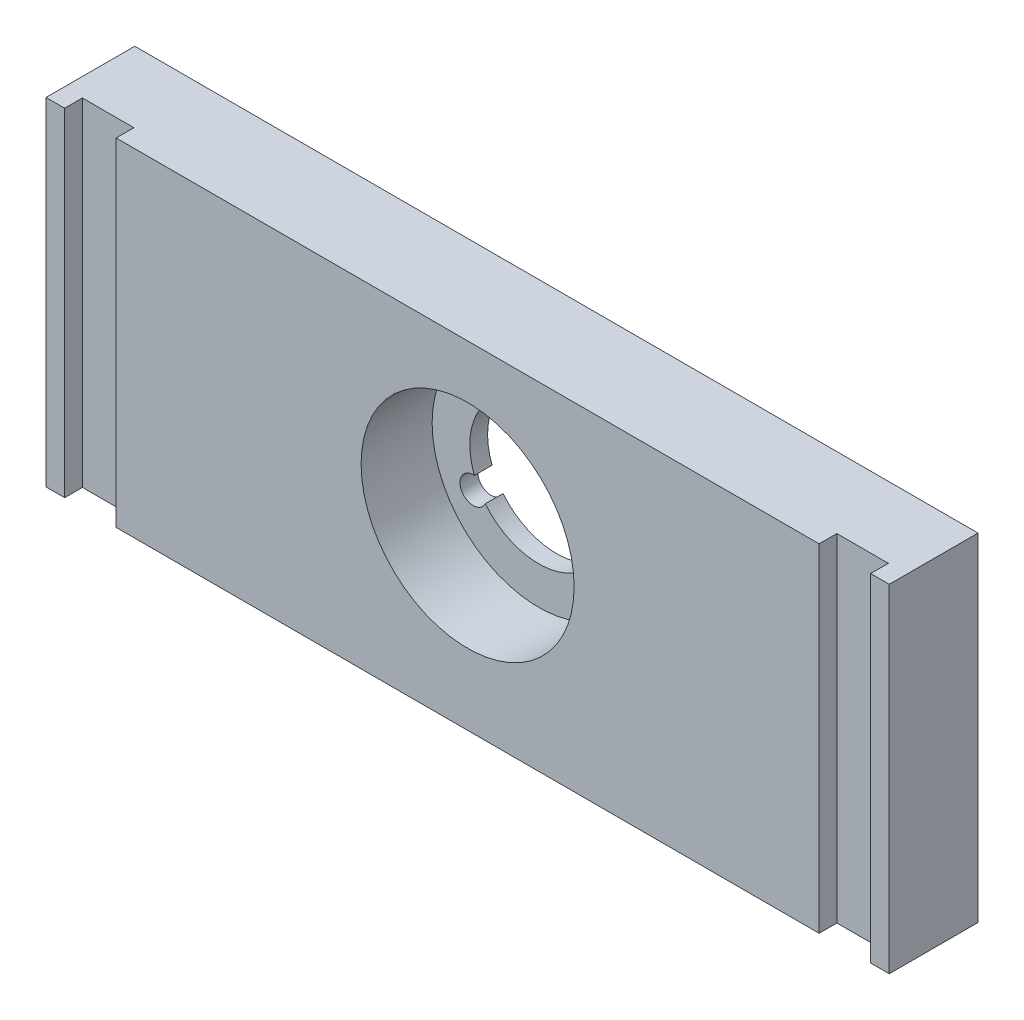
ISO-10303-21;
HEADER;
FILE_DESCRIPTION(('STEP AP214'),'2;1');
FILE_NAME('part.step','',(''),(''),'','','');
FILE_SCHEMA(('AUTOMOTIVE_DESIGN { 1 0 10303 214 1 1 1 1 }'));
ENDSEC;
DATA;
#1=APPLICATION_CONTEXT('core data for automotive mechanical design processes');
#2=APPLICATION_PROTOCOL_DEFINITION('international standard','automotive_design',2000,#1);
#3=PRODUCT_CONTEXT('',#1,'mechanical');
#4=PRODUCT('Part','Part','',(#3));
#5=PRODUCT_RELATED_PRODUCT_CATEGORY('part','',(#4));
#6=PRODUCT_DEFINITION_FORMATION('','',#4);
#7=PRODUCT_DEFINITION_CONTEXT('part definition',#1,'design');
#8=PRODUCT_DEFINITION('design','',#6,#7);
#9=PRODUCT_DEFINITION_SHAPE('','',#8);
#10=(LENGTH_UNIT() NAMED_UNIT(*) SI_UNIT(.MILLI.,.METRE.));
#11=(NAMED_UNIT(*) PLANE_ANGLE_UNIT() SI_UNIT($,.RADIAN.));
#12=(NAMED_UNIT(*) SI_UNIT($,.STERADIAN.) SOLID_ANGLE_UNIT());
#13=UNCERTAINTY_MEASURE_WITH_UNIT(LENGTH_MEASURE(1.E-05),#10,'distance_accuracy_value','');
#14=(GEOMETRIC_REPRESENTATION_CONTEXT(3) GLOBAL_UNCERTAINTY_ASSIGNED_CONTEXT((#13)) GLOBAL_UNIT_ASSIGNED_CONTEXT((#10,
#11,#12)) REPRESENTATION_CONTEXT('',''));
#15=CARTESIAN_POINT('',(0.,0.,0.));
#16=DIRECTION('',(0.,0.,1.));
#17=DIRECTION('',(1.,0.,0.));
#18=AXIS2_PLACEMENT_3D('',#15,#16,#17);
#19=CARTESIAN_POINT('',(3.,-2.,10.));
#20=DIRECTION('',(0.,0.,-1.));
#21=DIRECTION('',(-1.,0.,0.));
#22=AXIS2_PLACEMENT_3D('',#19,#20,#21);
#23=PLANE('',#22);
#24=CARTESIAN_POINT('',(50.5,-20.,10.));
#25=DIRECTION('',(0.,0.,1.));
#26=DIRECTION('',(1.,0.,0.));
#27=AXIS2_PLACEMENT_3D('',#24,#25,#26);
#28=CIRCLE('',#27,12.);
#29=CARTESIAN_POINT('',(62.5,-20.,10.));
#30=VERTEX_POINT('',#29);
#31=EDGE_CURVE('E207',#30,#30,#28,.T.);
#32=ORIENTED_EDGE('',*,*,#31,.F.);
#33=EDGE_LOOP('',(#32));
#34=FACE_BOUND('',#33,.T.);
#35=DIRECTION('',(1.,0.,0.));
#36=VECTOR('',#35,1.);
#37=CARTESIAN_POINT('',(98.,-40.,10.));
#38=LINE('',#37,#36);
#39=CARTESIAN_POINT('',(10.9,-40.,10.));
#40=VERTEX_POINT('',#39);
#41=CARTESIAN_POINT('',(90.1,-40.,10.));
#42=VERTEX_POINT('',#41);
#43=EDGE_CURVE('E274',#40,#42,#38,.T.);
#44=ORIENTED_EDGE('',*,*,#43,.T.);
#45=DIRECTION('',(0.,-1.,0.));
#46=VECTOR('',#45,1.);
#47=CARTESIAN_POINT('',(90.1,-40.,10.));
#48=LINE('',#47,#46);
#49=CARTESIAN_POINT('',(90.1,-2.,10.));
#50=VERTEX_POINT('',#49);
#51=EDGE_CURVE('E161',#50,#42,#48,.T.);
#52=ORIENTED_EDGE('',*,*,#51,.F.);
#53=DIRECTION('',(-1.,0.,0.));
#54=VECTOR('',#53,1.);
#55=CARTESIAN_POINT('',(3.,-2.,10.));
#56=LINE('',#55,#54);
#57=CARTESIAN_POINT('',(10.9,-2.,10.));
#58=VERTEX_POINT('',#57);
#59=EDGE_CURVE('E281',#50,#58,#56,.T.);
#60=ORIENTED_EDGE('',*,*,#59,.T.);
#61=DIRECTION('',(0.,1.,0.));
#62=VECTOR('',#61,1.);
#63=CARTESIAN_POINT('',(10.9,-40.,10.));
#64=LINE('',#63,#62);
#65=EDGE_CURVE('E186',#40,#58,#64,.T.);
#66=ORIENTED_EDGE('',*,*,#65,.F.);
#67=EDGE_LOOP('',(#44,#52,#60,#66));
#68=FACE_BOUND('',#67,.T.);
#69=ADVANCED_FACE('F31',(#34,#68),#23,.F.);
#70=CARTESIAN_POINT('',(3.,-40.,10.));
#71=VERTEX_POINT('',#70);
#72=CARTESIAN_POINT('',(5.1,-40.,10.));
#73=VERTEX_POINT('',#72);
#74=EDGE_CURVE('E270',#71,#73,#38,.T.);
#75=ORIENTED_EDGE('',*,*,#74,.T.);
#76=DIRECTION('',(0.,-1.,0.));
#77=VECTOR('',#76,1.);
#78=CARTESIAN_POINT('',(5.1,-40.,10.));
#79=LINE('',#78,#77);
#80=CARTESIAN_POINT('',(5.1,-2.,10.));
#81=VERTEX_POINT('',#80);
#82=EDGE_CURVE('E193',#81,#73,#79,.T.);
#83=ORIENTED_EDGE('',*,*,#82,.F.);
#84=CARTESIAN_POINT('',(3.,-2.,10.));
#85=VERTEX_POINT('',#84);
#86=EDGE_CURVE('E276',#81,#85,#56,.T.);
#87=ORIENTED_EDGE('',*,*,#86,.T.);
#88=DIRECTION('',(0.,-1.,0.));
#89=VECTOR('',#88,1.);
#90=CARTESIAN_POINT('',(3.,-40.,10.));
#91=LINE('',#90,#89);
#92=EDGE_CURVE('E265',#85,#71,#91,.T.);
#93=ORIENTED_EDGE('',*,*,#92,.T.);
#94=EDGE_LOOP('',(#75,#83,#87,#93));
#95=FACE_BOUND('',#94,.T.);
#96=ADVANCED_FACE('F334',(#95),#23,.F.);
#97=CARTESIAN_POINT('',(50.5,-20.,10.));
#98=DIRECTION('',(0.,0.,-1.));
#99=DIRECTION('',(-1.,0.,0.));
#100=AXIS2_PLACEMENT_3D('',#97,#98,#99);
#101=CYLINDRICAL_SURFACE('',#100,7.75);
#102=DIRECTION('',(0.,0.,-1.));
#103=VECTOR('',#102,1.);
#104=CARTESIAN_POINT('',(57.7439441639614,-22.754591249062,10.));
#105=LINE('',#104,#103);
#106=CARTESIAN_POINT('',(57.7439441639614,-22.754591249062,2.));
#107=VERTEX_POINT('',#106);
#108=CARTESIAN_POINT('',(57.7439441639614,-22.754591249062,0.));
#109=VERTEX_POINT('',#108);
#110=EDGE_CURVE('E252',#107,#109,#105,.T.);
#111=ORIENTED_EDGE('',*,*,#110,.F.);
#112=CARTESIAN_POINT('',(50.5,-20.,2.));
#113=DIRECTION('',(0.,0.,1.));
#114=DIRECTION('',(1.,0.,0.));
#115=AXIS2_PLACEMENT_3D('',#112,#113,#114);
#116=CIRCLE('',#115,7.75);
#117=CARTESIAN_POINT('',(51.7364260832507,-12.3492647058823,2.));
#118=VERTEX_POINT('',#117);
#119=EDGE_CURVE('E231',#107,#118,#116,.T.);
#120=ORIENTED_EDGE('',*,*,#119,.T.);
#121=DIRECTION('',(0.,0.,-1.));
#122=VECTOR('',#121,1.);
#123=CARTESIAN_POINT('',(51.7364260832507,-12.3492647058823,10.));
#124=LINE('',#123,#122);
#125=CARTESIAN_POINT('',(51.7364260832507,-12.3492647058823,0.));
#126=VERTEX_POINT('',#125);
#127=EDGE_CURVE('E262',#118,#126,#124,.T.);
#128=ORIENTED_EDGE('',*,*,#127,.T.);
#129=CARTESIAN_POINT('',(50.5,-20.,0.));
#130=DIRECTION('',(0.,0.,1.));
#131=DIRECTION('',(1.,0.,0.));
#132=AXIS2_PLACEMENT_3D('',#129,#130,#131);
#133=CIRCLE('',#132,7.75);
#134=EDGE_CURVE('E234',#109,#126,#133,.T.);
#135=ORIENTED_EDGE('',*,*,#134,.F.);
#136=EDGE_LOOP('',(#111,#120,#128,#135));
#137=FACE_BOUND('',#136,.T.);
#138=ADVANCED_FACE('F336',(#137),#101,.F.);
#139=CARTESIAN_POINT('',(50.5,-11.5,10.));
#140=DIRECTION('',(0.,0.,-1.));
#141=DIRECTION('',(-1.,0.,0.));
#142=AXIS2_PLACEMENT_3D('',#139,#140,#141);
#143=CYLINDRICAL_SURFACE('',#142,1.5);
#144=ORIENTED_EDGE('',*,*,#127,.F.);
#145=CARTESIAN_POINT('',(50.5,-11.5,2.));
#146=DIRECTION('',(0.,0.,1.));
#147=DIRECTION('',(1.,0.,0.));
#148=AXIS2_PLACEMENT_3D('',#145,#146,#147);
#149=CIRCLE('',#148,1.5);
#150=CARTESIAN_POINT('',(49.2635739167494,-12.3492647058823,2.));
#151=VERTEX_POINT('',#150);
#152=EDGE_CURVE('E228',#118,#151,#149,.T.);
#153=ORIENTED_EDGE('',*,*,#152,.T.);
#154=DIRECTION('',(0.,0.,-1.));
#155=VECTOR('',#154,1.);
#156=CARTESIAN_POINT('',(49.2635739167494,-12.3492647058823,10.));
#157=LINE('',#156,#155);
#158=CARTESIAN_POINT('',(49.2635739167494,-12.3492647058823,0.));
#159=VERTEX_POINT('',#158);
#160=EDGE_CURVE('E260',#151,#159,#157,.T.);
#161=ORIENTED_EDGE('',*,*,#160,.T.);
#162=CARTESIAN_POINT('',(50.5,-11.5,0.));
#163=DIRECTION('',(0.,0.,1.));
#164=DIRECTION('',(1.,0.,0.));
#165=AXIS2_PLACEMENT_3D('',#162,#163,#164);
#166=CIRCLE('',#165,1.5);
#167=EDGE_CURVE('E237',#126,#159,#166,.T.);
#168=ORIENTED_EDGE('',*,*,#167,.F.);
#169=EDGE_LOOP('',(#144,#153,#161,#168));
#170=FACE_BOUND('',#169,.T.);
#171=ADVANCED_FACE('F342',(#170),#143,.F.);
#172=CARTESIAN_POINT('',(50.5,-20.,10.));
#173=DIRECTION('',(0.,0.,-1.));
#174=DIRECTION('',(-1.,0.,0.));
#175=AXIS2_PLACEMENT_3D('',#172,#173,#174);
#176=CYLINDRICAL_SURFACE('',#175,7.75);
#177=ORIENTED_EDGE('',*,*,#160,.F.);
#178=CARTESIAN_POINT('',(50.5,-20.,2.));
#179=DIRECTION('',(0.,0.,1.));
#180=DIRECTION('',(1.,0.,0.));
#181=AXIS2_PLACEMENT_3D('',#178,#179,#180);
#182=CIRCLE('',#181,7.75);
#183=CARTESIAN_POINT('',(43.2560558360386,-22.754591249062,2.));
#184=VERTEX_POINT('',#183);
#185=EDGE_CURVE('E225',#151,#184,#182,.T.);
#186=ORIENTED_EDGE('',*,*,#185,.T.);
#187=DIRECTION('',(0.,0.,-1.));
#188=VECTOR('',#187,1.);
#189=CARTESIAN_POINT('',(43.2560558360386,-22.754591249062,10.));
#190=LINE('',#189,#188);
#191=CARTESIAN_POINT('',(43.2560558360386,-22.754591249062,0.));
#192=VERTEX_POINT('',#191);
#193=EDGE_CURVE('E258',#184,#192,#190,.T.);
#194=ORIENTED_EDGE('',*,*,#193,.T.);
#195=CARTESIAN_POINT('',(50.5,-20.,0.));
#196=DIRECTION('',(0.,0.,1.));
#197=DIRECTION('',(1.,0.,0.));
#198=AXIS2_PLACEMENT_3D('',#195,#196,#197);
#199=CIRCLE('',#198,7.75);
#200=EDGE_CURVE('E240',#159,#192,#199,.T.);
#201=ORIENTED_EDGE('',*,*,#200,.F.);
#202=EDGE_LOOP('',(#177,#186,#194,#201));
#203=FACE_BOUND('',#202,.T.);
#204=ADVANCED_FACE('F369',(#203),#176,.F.);
#205=CARTESIAN_POINT('',(43.1387840678324,-24.25,10.));
#206=DIRECTION('',(0.,0.,-1.));
#207=DIRECTION('',(-1.,0.,0.));
#208=AXIS2_PLACEMENT_3D('',#205,#206,#207);
#209=CYLINDRICAL_SURFACE('',#208,1.50000000000001);
#210=ORIENTED_EDGE('',*,*,#193,.F.);
#211=CARTESIAN_POINT('',(43.1387840678324,-24.25,2.));
#212=DIRECTION('',(0.,0.,1.));
#213=DIRECTION('',(1.,0.,0.));
#214=AXIS2_PLACEMENT_3D('',#211,#212,#213);
#215=CIRCLE('',#214,1.50000000000001);
#216=CARTESIAN_POINT('',(44.4924819192894,-24.8961440450557,2.));
#217=VERTEX_POINT('',#216);
#218=EDGE_CURVE('E222',#184,#217,#215,.T.);
#219=ORIENTED_EDGE('',*,*,#218,.T.);
#220=DIRECTION('',(0.,0.,-1.));
#221=VECTOR('',#220,1.);
#222=CARTESIAN_POINT('',(44.4924819192894,-24.8961440450557,10.));
#223=LINE('',#222,#221);
#224=CARTESIAN_POINT('',(44.4924819192894,-24.8961440450557,0.));
#225=VERTEX_POINT('',#224);
#226=EDGE_CURVE('E256',#217,#225,#223,.T.);
#227=ORIENTED_EDGE('',*,*,#226,.T.);
#228=CARTESIAN_POINT('',(43.1387840678324,-24.25,0.));
#229=DIRECTION('',(0.,0.,1.));
#230=DIRECTION('',(1.,0.,0.));
#231=AXIS2_PLACEMENT_3D('',#228,#229,#230);
#232=CIRCLE('',#231,1.50000000000001);
#233=EDGE_CURVE('E243',#192,#225,#232,.T.);
#234=ORIENTED_EDGE('',*,*,#233,.F.);
#235=EDGE_LOOP('',(#210,#219,#227,#234));
#236=FACE_BOUND('',#235,.T.);
#237=ADVANCED_FACE('F359',(#236),#209,.F.);
#238=CARTESIAN_POINT('',(50.5,-20.,10.));
#239=DIRECTION('',(0.,0.,-1.));
#240=DIRECTION('',(-1.,0.,0.));
#241=AXIS2_PLACEMENT_3D('',#238,#239,#240);
#242=CYLINDRICAL_SURFACE('',#241,7.75);
#243=ORIENTED_EDGE('',*,*,#226,.F.);
#244=CARTESIAN_POINT('',(50.5,-20.,2.));
#245=DIRECTION('',(0.,0.,1.));
#246=DIRECTION('',(1.,0.,0.));
#247=AXIS2_PLACEMENT_3D('',#244,#245,#246);
#248=CIRCLE('',#247,7.75);
#249=CARTESIAN_POINT('',(56.5075180807109,-24.8961440450554,2.));
#250=VERTEX_POINT('',#249);
#251=EDGE_CURVE('E217',#217,#250,#248,.T.);
#252=ORIENTED_EDGE('',*,*,#251,.T.);
#253=DIRECTION('',(0.,0.,-1.));
#254=VECTOR('',#253,1.);
#255=CARTESIAN_POINT('',(56.5075180807109,-24.8961440450554,10.));
#256=LINE('',#255,#254);
#257=CARTESIAN_POINT('',(56.5075180807109,-24.8961440450554,0.));
#258=VERTEX_POINT('',#257);
#259=EDGE_CURVE('E254',#250,#258,#256,.T.);
#260=ORIENTED_EDGE('',*,*,#259,.T.);
#261=CARTESIAN_POINT('',(50.5,-20.,0.));
#262=DIRECTION('',(0.,0.,1.));
#263=DIRECTION('',(1.,0.,0.));
#264=AXIS2_PLACEMENT_3D('',#261,#262,#263);
#265=CIRCLE('',#264,7.75);
#266=EDGE_CURVE('E246',#225,#258,#265,.T.);
#267=ORIENTED_EDGE('',*,*,#266,.F.);
#268=EDGE_LOOP('',(#243,#252,#260,#267));
#269=FACE_BOUND('',#268,.T.);
#270=ADVANCED_FACE('F353',(#269),#242,.F.);
#271=CARTESIAN_POINT('',(57.8612159321679,-24.2499999999999,10.));
#272=DIRECTION('',(0.,0.,-1.));
#273=DIRECTION('',(-1.,0.,0.));
#274=AXIS2_PLACEMENT_3D('',#271,#272,#273);
#275=CYLINDRICAL_SURFACE('',#274,1.5);
#276=ORIENTED_EDGE('',*,*,#259,.F.);
#277=CARTESIAN_POINT('',(57.8612159321679,-24.2499999999999,2.));
#278=DIRECTION('',(0.,0.,1.));
#279=DIRECTION('',(1.,0.,0.));
#280=AXIS2_PLACEMENT_3D('',#277,#278,#279);
#281=CIRCLE('',#280,1.5);
#282=EDGE_CURVE('E11',#250,#107,#281,.T.);
#283=ORIENTED_EDGE('',*,*,#282,.T.);
#284=ORIENTED_EDGE('',*,*,#110,.T.);
#285=CARTESIAN_POINT('',(57.8612159321679,-24.2499999999999,0.));
#286=DIRECTION('',(0.,0.,1.));
#287=DIRECTION('',(1.,0.,0.));
#288=AXIS2_PLACEMENT_3D('',#285,#286,#287);
#289=CIRCLE('',#288,1.5);
#290=EDGE_CURVE('E249',#258,#109,#289,.T.);
#291=ORIENTED_EDGE('',*,*,#290,.F.);
#292=EDGE_LOOP('',(#276,#283,#284,#291));
#293=FACE_BOUND('',#292,.T.);
#294=ADVANCED_FACE('F348',(#293),#275,.F.);
#295=CARTESIAN_POINT('',(98.,-2.,10.));
#296=VERTEX_POINT('',#295);
#297=CARTESIAN_POINT('',(95.9,-2.,10.));
#298=VERTEX_POINT('',#297);
#299=EDGE_CURVE('E277',#296,#298,#56,.T.);
#300=ORIENTED_EDGE('',*,*,#299,.T.);
#301=DIRECTION('',(0.,1.,0.));
#302=VECTOR('',#301,1.);
#303=CARTESIAN_POINT('',(95.9,-40.,10.));
#304=LINE('',#303,#302);
#305=CARTESIAN_POINT('',(95.9,-40.,10.));
#306=VERTEX_POINT('',#305);
#307=EDGE_CURVE('E174',#306,#298,#304,.T.);
#308=ORIENTED_EDGE('',*,*,#307,.F.);
#309=CARTESIAN_POINT('',(98.,-40.,10.));
#310=VERTEX_POINT('',#309);
#311=EDGE_CURVE('E268',#306,#310,#38,.T.);
#312=ORIENTED_EDGE('',*,*,#311,.T.);
#313=DIRECTION('',(0.,1.,0.));
#314=VECTOR('',#313,1.);
#315=CARTESIAN_POINT('',(98.,-2.,10.));
#316=LINE('',#315,#314);
#317=EDGE_CURVE('E273',#310,#296,#316,.T.);
#318=ORIENTED_EDGE('',*,*,#317,.T.);
#319=EDGE_LOOP('',(#300,#308,#312,#318));
#320=FACE_BOUND('',#319,.T.);
#321=ADVANCED_FACE('F318',(#320),#23,.F.);
#322=CARTESIAN_POINT('',(3.,-2.,0.));
#323=DIRECTION('',(0.,0.,-1.));
#324=DIRECTION('',(-1.,0.,0.));
#325=AXIS2_PLACEMENT_3D('',#322,#323,#324);
#326=PLANE('',#325);
#327=DIRECTION('',(0.,-1.,0.));
#328=VECTOR('',#327,1.);
#329=CARTESIAN_POINT('',(3.,-40.,0.));
#330=LINE('',#329,#328);
#331=CARTESIAN_POINT('',(3.,-2.,0.));
#332=VERTEX_POINT('',#331);
#333=CARTESIAN_POINT('',(3.,-40.,0.));
#334=VERTEX_POINT('',#333);
#335=EDGE_CURVE('E264',#332,#334,#330,.T.);
#336=ORIENTED_EDGE('',*,*,#335,.F.);
#337=DIRECTION('',(-1.,0.,0.));
#338=VECTOR('',#337,1.);
#339=CARTESIAN_POINT('',(3.,-2.,0.));
#340=LINE('',#339,#338);
#341=CARTESIAN_POINT('',(98.,-2.,0.));
#342=VERTEX_POINT('',#341);
#343=EDGE_CURVE('E269',#342,#332,#340,.T.);
#344=ORIENTED_EDGE('',*,*,#343,.F.);
#345=DIRECTION('',(0.,1.,0.));
#346=VECTOR('',#345,1.);
#347=CARTESIAN_POINT('',(98.,-2.,0.));
#348=LINE('',#347,#346);
#349=CARTESIAN_POINT('',(98.,-40.,0.));
#350=VERTEX_POINT('',#349);
#351=EDGE_CURVE('E286',#350,#342,#348,.T.);
#352=ORIENTED_EDGE('',*,*,#351,.F.);
#353=DIRECTION('',(1.,0.,0.));
#354=VECTOR('',#353,1.);
#355=CARTESIAN_POINT('',(98.,-40.,0.));
#356=LINE('',#355,#354);
#357=EDGE_CURVE('E284',#334,#350,#356,.T.);
#358=ORIENTED_EDGE('',*,*,#357,.F.);
#359=EDGE_LOOP('',(#336,#344,#352,#358));
#360=FACE_BOUND('',#359,.T.);
#361=ORIENTED_EDGE('',*,*,#290,.T.);
#362=ORIENTED_EDGE('',*,*,#134,.T.);
#363=ORIENTED_EDGE('',*,*,#167,.T.);
#364=ORIENTED_EDGE('',*,*,#200,.T.);
#365=ORIENTED_EDGE('',*,*,#233,.T.);
#366=ORIENTED_EDGE('',*,*,#266,.T.);
#367=EDGE_LOOP('',(#361,#362,#363,#364,#365,#366));
#368=FACE_BOUND('',#367,.T.);
#369=ADVANCED_FACE('F305',(#360,#368),#326,.T.);
#370=CARTESIAN_POINT('',(3.,-40.,10.));
#371=DIRECTION('',(1.,0.,0.));
#372=DIRECTION('',(0.,0.,-1.));
#373=AXIS2_PLACEMENT_3D('',#370,#371,#372);
#374=PLANE('',#373);
#375=ORIENTED_EDGE('',*,*,#335,.T.);
#376=DIRECTION('',(0.,0.,-1.));
#377=VECTOR('',#376,1.);
#378=CARTESIAN_POINT('',(3.,-40.,10.));
#379=LINE('',#378,#377);
#380=EDGE_CURVE('E39',#71,#334,#379,.T.);
#381=ORIENTED_EDGE('',*,*,#380,.F.);
#382=ORIENTED_EDGE('',*,*,#92,.F.);
#383=DIRECTION('',(0.,0.,-1.));
#384=VECTOR('',#383,1.);
#385=CARTESIAN_POINT('',(3.,-2.,10.));
#386=LINE('',#385,#384);
#387=EDGE_CURVE('E280',#85,#332,#386,.T.);
#388=ORIENTED_EDGE('',*,*,#387,.T.);
#389=EDGE_LOOP('',(#375,#381,#382,#388));
#390=FACE_BOUND('',#389,.T.);
#391=ADVANCED_FACE('F33',(#390),#374,.F.);
#392=CARTESIAN_POINT('',(98.,-40.,10.));
#393=DIRECTION('',(0.,1.,0.));
#394=DIRECTION('',(-1.,0.,0.));
#395=AXIS2_PLACEMENT_3D('',#392,#393,#394);
#396=PLANE('',#395);
#397=DIRECTION('',(1.,0.,0.));
#398=VECTOR('',#397,1.);
#399=CARTESIAN_POINT('',(90.1,-40.,8.));
#400=LINE('',#399,#398);
#401=CARTESIAN_POINT('',(90.1,-40.,8.));
#402=VERTEX_POINT('',#401);
#403=CARTESIAN_POINT('',(95.9,-40.,8.));
#404=VERTEX_POINT('',#403);
#405=EDGE_CURVE('E170',#402,#404,#400,.T.);
#406=ORIENTED_EDGE('',*,*,#405,.F.);
#407=DIRECTION('',(0.,0.,1.));
#408=VECTOR('',#407,1.);
#409=CARTESIAN_POINT('',(90.1,-40.,8.));
#410=LINE('',#409,#408);
#411=EDGE_CURVE('E156',#402,#42,#410,.T.);
#412=ORIENTED_EDGE('',*,*,#411,.T.);
#413=ORIENTED_EDGE('',*,*,#43,.F.);
#414=DIRECTION('',(0.,0.,1.));
#415=VECTOR('',#414,1.);
#416=CARTESIAN_POINT('',(10.9,-40.,8.));
#417=LINE('',#416,#415);
#418=CARTESIAN_POINT('',(10.9,-40.,8.));
#419=VERTEX_POINT('',#418);
#420=EDGE_CURVE('E200',#419,#40,#417,.T.);
#421=ORIENTED_EDGE('',*,*,#420,.F.);
#422=DIRECTION('',(1.,0.,0.));
#423=VECTOR('',#422,1.);
#424=CARTESIAN_POINT('',(10.9,-40.,8.));
#425=LINE('',#424,#423);
#426=CARTESIAN_POINT('',(5.1,-40.,8.));
#427=VERTEX_POINT('',#426);
#428=EDGE_CURVE('E191',#427,#419,#425,.T.);
#429=ORIENTED_EDGE('',*,*,#428,.F.);
#430=DIRECTION('',(0.,0.,1.));
#431=VECTOR('',#430,1.);
#432=CARTESIAN_POINT('',(5.1,-40.,8.));
#433=LINE('',#432,#431);
#434=EDGE_CURVE('E204',#427,#73,#433,.T.);
#435=ORIENTED_EDGE('',*,*,#434,.T.);
#436=ORIENTED_EDGE('',*,*,#74,.F.);
#437=ORIENTED_EDGE('',*,*,#380,.T.);
#438=ORIENTED_EDGE('',*,*,#357,.T.);
#439=DIRECTION('',(0.,0.,-1.));
#440=VECTOR('',#439,1.);
#441=CARTESIAN_POINT('',(98.,-40.,10.));
#442=LINE('',#441,#440);
#443=EDGE_CURVE('E294',#310,#350,#442,.T.);
#444=ORIENTED_EDGE('',*,*,#443,.F.);
#445=ORIENTED_EDGE('',*,*,#311,.F.);
#446=DIRECTION('',(0.,0.,1.));
#447=VECTOR('',#446,1.);
#448=CARTESIAN_POINT('',(95.9,-40.,8.));
#449=LINE('',#448,#447);
#450=EDGE_CURVE('E166',#404,#306,#449,.T.);
#451=ORIENTED_EDGE('',*,*,#450,.F.);
#452=EDGE_LOOP('',(#406,#412,#413,#421,#429,#435,#436,#437,#438,#444,#445,#451));
#453=FACE_BOUND('',#452,.T.);
#454=ADVANCED_FACE('F176',(#453),#396,.F.);
#455=CARTESIAN_POINT('',(98.,-2.,10.));
#456=DIRECTION('',(-1.,0.,0.));
#457=DIRECTION('',(0.,0.,1.));
#458=AXIS2_PLACEMENT_3D('',#455,#456,#457);
#459=PLANE('',#458);
#460=ORIENTED_EDGE('',*,*,#351,.T.);
#461=DIRECTION('',(0.,0.,-1.));
#462=VECTOR('',#461,1.);
#463=CARTESIAN_POINT('',(98.,-2.,10.));
#464=LINE('',#463,#462);
#465=EDGE_CURVE('E291',#296,#342,#464,.T.);
#466=ORIENTED_EDGE('',*,*,#465,.F.);
#467=ORIENTED_EDGE('',*,*,#317,.F.);
#468=ORIENTED_EDGE('',*,*,#443,.T.);
#469=EDGE_LOOP('',(#460,#466,#467,#468));
#470=FACE_BOUND('',#469,.T.);
#471=ADVANCED_FACE('F310',(#470),#459,.F.);
#472=CARTESIAN_POINT('',(3.,-2.,10.));
#473=DIRECTION('',(0.,-1.,0.));
#474=DIRECTION('',(0.,0.,-1.));
#475=AXIS2_PLACEMENT_3D('',#472,#473,#474);
#476=PLANE('',#475);
#477=ORIENTED_EDGE('',*,*,#59,.F.);
#478=DIRECTION('',(0.,0.,1.));
#479=VECTOR('',#478,1.);
#480=CARTESIAN_POINT('',(90.1,-2.,8.));
#481=LINE('',#480,#479);
#482=CARTESIAN_POINT('',(90.1,-2.,8.));
#483=VERTEX_POINT('',#482);
#484=EDGE_CURVE('E184',#483,#50,#481,.T.);
#485=ORIENTED_EDGE('',*,*,#484,.F.);
#486=DIRECTION('',(-1.,0.,0.));
#487=VECTOR('',#486,1.);
#488=CARTESIAN_POINT('',(95.9,-2.,8.));
#489=LINE('',#488,#487);
#490=CARTESIAN_POINT('',(95.9,-2.,8.));
#491=VERTEX_POINT('',#490);
#492=EDGE_CURVE('E167',#491,#483,#489,.T.);
#493=ORIENTED_EDGE('',*,*,#492,.F.);
#494=DIRECTION('',(0.,0.,1.));
#495=VECTOR('',#494,1.);
#496=CARTESIAN_POINT('',(95.9,-2.,8.));
#497=LINE('',#496,#495);
#498=EDGE_CURVE('E187',#491,#298,#497,.T.);
#499=ORIENTED_EDGE('',*,*,#498,.T.);
#500=ORIENTED_EDGE('',*,*,#299,.F.);
#501=ORIENTED_EDGE('',*,*,#465,.T.);
#502=ORIENTED_EDGE('',*,*,#343,.T.);
#503=ORIENTED_EDGE('',*,*,#387,.F.);
#504=ORIENTED_EDGE('',*,*,#86,.F.);
#505=DIRECTION('',(0.,0.,1.));
#506=VECTOR('',#505,1.);
#507=CARTESIAN_POINT('',(5.1,-2.,8.));
#508=LINE('',#507,#506);
#509=CARTESIAN_POINT('',(5.1,-2.,8.));
#510=VERTEX_POINT('',#509);
#511=EDGE_CURVE('E208',#510,#81,#508,.T.);
#512=ORIENTED_EDGE('',*,*,#511,.F.);
#513=DIRECTION('',(-1.,0.,0.));
#514=VECTOR('',#513,1.);
#515=CARTESIAN_POINT('',(5.1,-2.,8.));
#516=LINE('',#515,#514);
#517=CARTESIAN_POINT('',(10.9,-2.,8.));
#518=VERTEX_POINT('',#517);
#519=EDGE_CURVE('E195',#518,#510,#516,.T.);
#520=ORIENTED_EDGE('',*,*,#519,.F.);
#521=DIRECTION('',(0.,0.,1.));
#522=VECTOR('',#521,1.);
#523=CARTESIAN_POINT('',(10.9,-2.,8.));
#524=LINE('',#523,#522);
#525=EDGE_CURVE('E210',#518,#58,#524,.T.);
#526=ORIENTED_EDGE('',*,*,#525,.T.);
#527=EDGE_LOOP('',(#477,#485,#493,#499,#500,#501,#502,#503,#504,#512,#520,#526));
#528=FACE_BOUND('',#527,.T.);
#529=ADVANCED_FACE('F315',(#528),#476,.F.);
#530=CARTESIAN_POINT('',(50.5,-20.,2.));
#531=DIRECTION('',(0.,0.,1.));
#532=DIRECTION('',(1.,0.,0.));
#533=AXIS2_PLACEMENT_3D('',#530,#531,#532);
#534=CYLINDRICAL_SURFACE('',#533,12.);
#535=CARTESIAN_POINT('',(50.5,-20.,2.));
#536=DIRECTION('',(0.,0.,1.));
#537=DIRECTION('',(1.,0.,0.));
#538=AXIS2_PLACEMENT_3D('',#535,#536,#537);
#539=CIRCLE('',#538,12.);
#540=CARTESIAN_POINT('',(62.5,-20.,2.));
#541=VERTEX_POINT('',#540);
#542=EDGE_CURVE('E214',#541,#541,#539,.T.);
#543=ORIENTED_EDGE('',*,*,#542,.F.);
#544=EDGE_LOOP('',(#543));
#545=FACE_BOUND('',#544,.T.);
#546=ORIENTED_EDGE('',*,*,#31,.T.);
#547=EDGE_LOOP('',(#546));
#548=FACE_BOUND('',#547,.T.);
#549=ADVANCED_FACE('F364',(#545,#548),#534,.F.);
#550=CARTESIAN_POINT('',(50.5,-20.,2.));
#551=DIRECTION('',(0.,0.,1.));
#552=DIRECTION('',(1.,0.,0.));
#553=AXIS2_PLACEMENT_3D('',#550,#551,#552);
#554=PLANE('',#553);
#555=ORIENTED_EDGE('',*,*,#282,.F.);
#556=ORIENTED_EDGE('',*,*,#251,.F.);
#557=ORIENTED_EDGE('',*,*,#218,.F.);
#558=ORIENTED_EDGE('',*,*,#185,.F.);
#559=ORIENTED_EDGE('',*,*,#152,.F.);
#560=ORIENTED_EDGE('',*,*,#119,.F.);
#561=EDGE_LOOP('',(#555,#556,#557,#558,#559,#560));
#562=FACE_BOUND('',#561,.T.);
#563=ORIENTED_EDGE('',*,*,#542,.T.);
#564=EDGE_LOOP('',(#563));
#565=FACE_BOUND('',#564,.T.);
#566=ADVANCED_FACE('F384',(#562,#565),#554,.T.);
#567=CARTESIAN_POINT('',(5.1,-40.,8.));
#568=DIRECTION('',(-1.,0.,0.));
#569=DIRECTION('',(0.,-1.,0.));
#570=AXIS2_PLACEMENT_3D('',#567,#568,#569);
#571=PLANE('',#570);
#572=ORIENTED_EDGE('',*,*,#82,.T.);
#573=ORIENTED_EDGE('',*,*,#434,.F.);
#574=DIRECTION('',(0.,-1.,0.));
#575=VECTOR('',#574,1.);
#576=CARTESIAN_POINT('',(5.1,-40.,8.));
#577=LINE('',#576,#575);
#578=EDGE_CURVE('E197',#510,#427,#577,.T.);
#579=ORIENTED_EDGE('',*,*,#578,.F.);
#580=ORIENTED_EDGE('',*,*,#511,.T.);
#581=EDGE_LOOP('',(#572,#573,#579,#580));
#582=FACE_BOUND('',#581,.T.);
#583=ADVANCED_FACE('F330',(#582),#571,.F.);
#584=CARTESIAN_POINT('',(10.9,-40.,8.));
#585=DIRECTION('',(1.,0.,0.));
#586=DIRECTION('',(0.,1.,0.));
#587=AXIS2_PLACEMENT_3D('',#584,#585,#586);
#588=PLANE('',#587);
#589=ORIENTED_EDGE('',*,*,#65,.T.);
#590=ORIENTED_EDGE('',*,*,#525,.F.);
#591=DIRECTION('',(0.,1.,0.));
#592=VECTOR('',#591,1.);
#593=CARTESIAN_POINT('',(10.9,-40.,8.));
#594=LINE('',#593,#592);
#595=EDGE_CURVE('E54',#419,#518,#594,.T.);
#596=ORIENTED_EDGE('',*,*,#595,.F.);
#597=ORIENTED_EDGE('',*,*,#420,.T.);
#598=EDGE_LOOP('',(#589,#590,#596,#597));
#599=FACE_BOUND('',#598,.T.);
#600=ADVANCED_FACE('F324',(#599),#588,.F.);
#601=CARTESIAN_POINT('',(5.1,-40.,8.));
#602=DIRECTION('',(0.,0.,-1.));
#603=DIRECTION('',(-1.,0.,0.));
#604=AXIS2_PLACEMENT_3D('',#601,#602,#603);
#605=PLANE('',#604);
#606=ORIENTED_EDGE('',*,*,#428,.T.);
#607=ORIENTED_EDGE('',*,*,#595,.T.);
#608=ORIENTED_EDGE('',*,*,#519,.T.);
#609=ORIENTED_EDGE('',*,*,#578,.T.);
#610=EDGE_LOOP('',(#606,#607,#608,#609));
#611=FACE_BOUND('',#610,.T.);
#612=ADVANCED_FACE('F326',(#611),#605,.F.);
#613=CARTESIAN_POINT('',(90.1,-40.,8.));
#614=DIRECTION('',(-1.,0.,0.));
#615=DIRECTION('',(0.,-1.,0.));
#616=AXIS2_PLACEMENT_3D('',#613,#614,#615);
#617=PLANE('',#616);
#618=ORIENTED_EDGE('',*,*,#51,.T.);
#619=ORIENTED_EDGE('',*,*,#411,.F.);
#620=DIRECTION('',(0.,-1.,0.));
#621=VECTOR('',#620,1.);
#622=CARTESIAN_POINT('',(90.1,-40.,8.));
#623=LINE('',#622,#621);
#624=EDGE_CURVE('E159',#483,#402,#623,.T.);
#625=ORIENTED_EDGE('',*,*,#624,.F.);
#626=ORIENTED_EDGE('',*,*,#484,.T.);
#627=EDGE_LOOP('',(#618,#619,#625,#626));
#628=FACE_BOUND('',#627,.T.);
#629=ADVANCED_FACE('F158',(#628),#617,.F.);
#630=CARTESIAN_POINT('',(95.9,-40.,8.));
#631=DIRECTION('',(1.,0.,0.));
#632=DIRECTION('',(0.,1.,0.));
#633=AXIS2_PLACEMENT_3D('',#630,#631,#632);
#634=PLANE('',#633);
#635=ORIENTED_EDGE('',*,*,#307,.T.);
#636=ORIENTED_EDGE('',*,*,#498,.F.);
#637=DIRECTION('',(0.,1.,0.));
#638=VECTOR('',#637,1.);
#639=CARTESIAN_POINT('',(95.9,-40.,8.));
#640=LINE('',#639,#638);
#641=EDGE_CURVE('E46',#404,#491,#640,.T.);
#642=ORIENTED_EDGE('',*,*,#641,.F.);
#643=ORIENTED_EDGE('',*,*,#450,.T.);
#644=EDGE_LOOP('',(#635,#636,#642,#643));
#645=FACE_BOUND('',#644,.T.);
#646=ADVANCED_FACE('F511',(#645),#634,.F.);
#647=CARTESIAN_POINT('',(90.1,-2.,8.));
#648=DIRECTION('',(0.,0.,1.));
#649=DIRECTION('',(1.,0.,0.));
#650=AXIS2_PLACEMENT_3D('',#647,#648,#649);
#651=PLANE('',#650);
#652=ORIENTED_EDGE('',*,*,#624,.T.);
#653=ORIENTED_EDGE('',*,*,#405,.T.);
#654=ORIENTED_EDGE('',*,*,#641,.T.);
#655=ORIENTED_EDGE('',*,*,#492,.T.);
#656=EDGE_LOOP('',(#652,#653,#654,#655));
#657=FACE_BOUND('',#656,.T.);
#658=ADVANCED_FACE('F169',(#657),#651,.T.);
#659=CLOSED_SHELL('',(#69,#96,#138,#171,#204,#237,#270,#294,#321,#369,#391,#454,#471,#529,#549,
#566,#583,#600,#612,#629,#646,#658));
#660=MANIFOLD_SOLID_BREP('B2',#659);
#661=ADVANCED_BREP_SHAPE_REPRESENTATION('',(#18,#660),#14);
#662=SHAPE_DEFINITION_REPRESENTATION(#9,#661);
ENDSEC;
END-ISO-10303-21;
